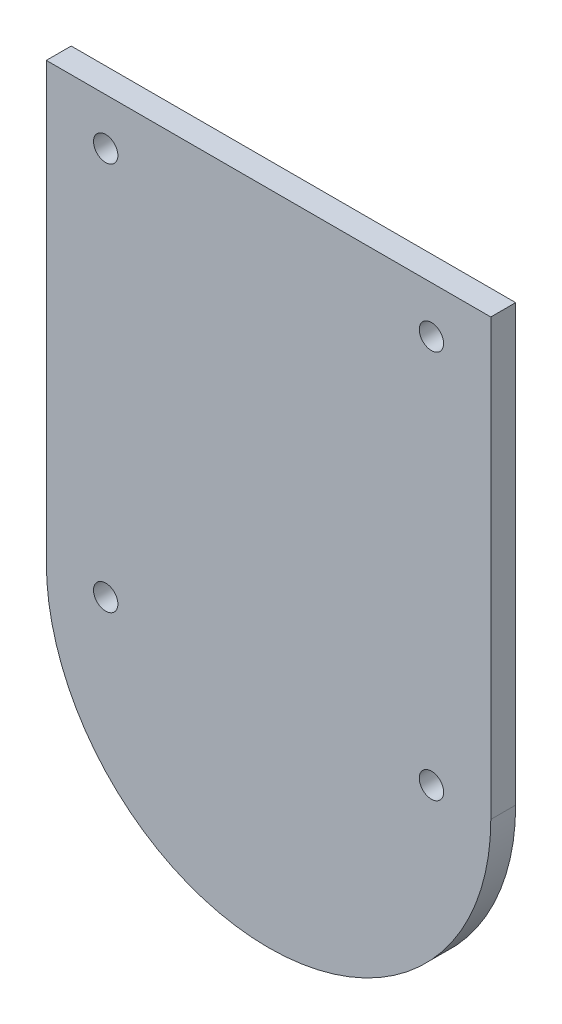
ISO-10303-21;
HEADER;
FILE_DESCRIPTION(('STEP AP214'),'2;1');
FILE_NAME('part.step','',(''),(''),'','','');
FILE_SCHEMA(('AUTOMOTIVE_DESIGN { 1 0 10303 214 1 1 1 1 }'));
ENDSEC;
DATA;
#1=APPLICATION_CONTEXT('core data for automotive mechanical design processes');
#2=APPLICATION_PROTOCOL_DEFINITION('international standard','automotive_design',2000,#1);
#3=PRODUCT_CONTEXT('',#1,'mechanical');
#4=PRODUCT('Part','Part','',(#3));
#5=PRODUCT_RELATED_PRODUCT_CATEGORY('part','',(#4));
#6=PRODUCT_DEFINITION_FORMATION('','',#4);
#7=PRODUCT_DEFINITION_CONTEXT('part definition',#1,'design');
#8=PRODUCT_DEFINITION('design','',#6,#7);
#9=PRODUCT_DEFINITION_SHAPE('','',#8);
#10=(LENGTH_UNIT() NAMED_UNIT(*) SI_UNIT(.MILLI.,.METRE.));
#11=(NAMED_UNIT(*) PLANE_ANGLE_UNIT() SI_UNIT($,.RADIAN.));
#12=(NAMED_UNIT(*) SI_UNIT($,.STERADIAN.) SOLID_ANGLE_UNIT());
#13=UNCERTAINTY_MEASURE_WITH_UNIT(LENGTH_MEASURE(1.E-05),#10,'distance_accuracy_value','');
#14=(GEOMETRIC_REPRESENTATION_CONTEXT(3) GLOBAL_UNCERTAINTY_ASSIGNED_CONTEXT((#13)) GLOBAL_UNIT_ASSIGNED_CONTEXT((#10,
#11,#12)) REPRESENTATION_CONTEXT('',''));
#15=CARTESIAN_POINT('',(0.,0.,0.));
#16=DIRECTION('',(0.,0.,1.));
#17=DIRECTION('',(1.,0.,0.));
#18=AXIS2_PLACEMENT_3D('',#15,#16,#17);
#19=CARTESIAN_POINT('',(0.,27.6698090416413,1.6));
#20=DIRECTION('',(0.,1.,0.));
#21=DIRECTION('',(0.,0.,1.));
#22=AXIS2_PLACEMENT_3D('',#19,#20,#21);
#23=PLANE('',#22);
#24=DIRECTION('',(1.,0.,0.));
#25=VECTOR('',#24,1.);
#26=CARTESIAN_POINT('',(0.,27.6698090416413,0.));
#27=LINE('',#26,#25);
#28=CARTESIAN_POINT('',(-37.2121128013917,27.6698090416413,0.));
#29=VERTEX_POINT('',#28);
#30=CARTESIAN_POINT('',(-8.61211280139167,27.6698090416413,0.));
#31=VERTEX_POINT('',#30);
#32=EDGE_CURVE('E75',#29,#31,#27,.T.);
#33=ORIENTED_EDGE('',*,*,#32,.F.);
#34=DIRECTION('',(0.,0.,-1.));
#35=VECTOR('',#34,1.);
#36=CARTESIAN_POINT('',(-37.2121128013917,27.6698090416413,1.6));
#37=LINE('',#36,#35);
#38=CARTESIAN_POINT('',(-37.2121128013917,27.6698090416413,1.6));
#39=VERTEX_POINT('',#38);
#40=EDGE_CURVE('E11',#39,#29,#37,.T.);
#41=ORIENTED_EDGE('',*,*,#40,.F.);
#42=DIRECTION('',(1.,0.,0.));
#43=VECTOR('',#42,1.);
#44=CARTESIAN_POINT('',(0.,27.6698090416413,1.6));
#45=LINE('',#44,#43);
#46=CARTESIAN_POINT('',(-8.61211280139167,27.6698090416413,1.6));
#47=VERTEX_POINT('',#46);
#48=EDGE_CURVE('E81',#39,#47,#45,.T.);
#49=ORIENTED_EDGE('',*,*,#48,.T.);
#50=DIRECTION('',(0.,0.,-1.));
#51=VECTOR('',#50,1.);
#52=CARTESIAN_POINT('',(-8.61211280139167,27.6698090416413,1.6));
#53=LINE('',#52,#51);
#54=EDGE_CURVE('E53',#47,#31,#53,.T.);
#55=ORIENTED_EDGE('',*,*,#54,.T.);
#56=EDGE_LOOP('',(#33,#41,#49,#55));
#57=FACE_BOUND('',#56,.T.);
#58=ADVANCED_FACE('F37',(#57),#23,.T.);
#59=CARTESIAN_POINT('',(-37.2121128013917,0.,1.6));
#60=DIRECTION('',(1.,0.,0.));
#61=DIRECTION('',(0.,0.,-1.));
#62=AXIS2_PLACEMENT_3D('',#59,#60,#61);
#63=PLANE('',#62);
#64=DIRECTION('',(0.,-1.,0.));
#65=VECTOR('',#64,1.);
#66=CARTESIAN_POINT('',(-37.2121128013917,0.,0.));
#67=LINE('',#66,#65);
#68=CARTESIAN_POINT('',(-37.2121128013917,-0.330212606078735,0.));
#69=VERTEX_POINT('',#68);
#70=EDGE_CURVE('E94',#29,#69,#67,.T.);
#71=ORIENTED_EDGE('',*,*,#70,.T.);
#72=DIRECTION('',(0.,0.,-1.));
#73=VECTOR('',#72,1.);
#74=CARTESIAN_POINT('',(-37.2121128013917,-0.330212606078735,1.6));
#75=LINE('',#74,#73);
#76=CARTESIAN_POINT('',(-37.2121128013917,-0.330212606078735,1.6));
#77=VERTEX_POINT('',#76);
#78=EDGE_CURVE('E45',#77,#69,#75,.T.);
#79=ORIENTED_EDGE('',*,*,#78,.F.);
#80=DIRECTION('',(0.,-1.,0.));
#81=VECTOR('',#80,1.);
#82=CARTESIAN_POINT('',(-37.2121128013917,0.,1.6));
#83=LINE('',#82,#81);
#84=EDGE_CURVE('E84',#39,#77,#83,.T.);
#85=ORIENTED_EDGE('',*,*,#84,.F.);
#86=ORIENTED_EDGE('',*,*,#40,.T.);
#87=EDGE_LOOP('',(#71,#79,#85,#86));
#88=FACE_BOUND('',#87,.T.);
#89=ADVANCED_FACE('F93',(#88),#63,.F.);
#90=CARTESIAN_POINT('',(-22.9121128013917,-0.330201782079756,1.6));
#91=DIRECTION('',(0.,0.,-1.));
#92=DIRECTION('',(-1.,0.,0.));
#93=AXIS2_PLACEMENT_3D('',#90,#91,#92);
#94=CYLINDRICAL_SURFACE('',#93,14.3000000000041);
#95=CARTESIAN_POINT('',(-22.9121128013917,-0.330201782079756,0.));
#96=DIRECTION('',(0.,0.,1.));
#97=DIRECTION('',(1.,0.,0.));
#98=AXIS2_PLACEMENT_3D('',#95,#96,#97);
#99=CIRCLE('',#98,14.3000000000041);
#100=CARTESIAN_POINT('',(-8.61211280139167,-0.330190958080777,0.));
#101=VERTEX_POINT('',#100);
#102=EDGE_CURVE('E117',#69,#101,#99,.T.);
#103=ORIENTED_EDGE('',*,*,#102,.T.);
#104=DIRECTION('',(0.,0.,-1.));
#105=VECTOR('',#104,1.);
#106=CARTESIAN_POINT('',(-8.61211280139167,-0.330190958080777,1.6));
#107=LINE('',#106,#105);
#108=CARTESIAN_POINT('',(-8.61211280139167,-0.330190958080777,1.6));
#109=VERTEX_POINT('',#108);
#110=EDGE_CURVE('E67',#109,#101,#107,.T.);
#111=ORIENTED_EDGE('',*,*,#110,.F.);
#112=CARTESIAN_POINT('',(-22.9121128013917,-0.330201782079756,1.6));
#113=DIRECTION('',(0.,0.,1.));
#114=DIRECTION('',(1.,0.,0.));
#115=AXIS2_PLACEMENT_3D('',#112,#113,#114);
#116=CIRCLE('',#115,14.3000000000041);
#117=EDGE_CURVE('E89',#77,#109,#116,.T.);
#118=ORIENTED_EDGE('',*,*,#117,.F.);
#119=ORIENTED_EDGE('',*,*,#78,.T.);
#120=EDGE_LOOP('',(#103,#111,#118,#119));
#121=FACE_BOUND('',#120,.T.);
#122=ADVANCED_FACE('F97',(#121),#94,.T.);
#123=CARTESIAN_POINT('',(-33.3921128013234,-0.330190958080774,1.6));
#124=DIRECTION('',(0.,0.,-1.));
#125=DIRECTION('',(-1.,0.,0.));
#126=AXIS2_PLACEMENT_3D('',#123,#124,#125);
#127=CYLINDRICAL_SURFACE('',#126,0.783493599999997);
#128=CARTESIAN_POINT('',(-33.3921128013234,-0.330190958080774,1.6));
#129=DIRECTION('',(0.,0.,1.));
#130=DIRECTION('',(1.,0.,0.));
#131=AXIS2_PLACEMENT_3D('',#128,#129,#130);
#132=CIRCLE('',#131,0.783493599999997);
#133=CARTESIAN_POINT('',(-32.6086192013234,-0.330190958080774,1.6));
#134=VERTEX_POINT('',#133);
#135=EDGE_CURVE('E109',#134,#134,#132,.T.);
#136=ORIENTED_EDGE('',*,*,#135,.T.);
#137=EDGE_LOOP('',(#136));
#138=FACE_BOUND('',#137,.T.);
#139=CARTESIAN_POINT('',(-33.3921128013234,-0.330190958080774,0.));
#140=DIRECTION('',(0.,0.,1.));
#141=DIRECTION('',(1.,0.,0.));
#142=AXIS2_PLACEMENT_3D('',#139,#140,#141);
#143=CIRCLE('',#142,0.783493599999997);
#144=CARTESIAN_POINT('',(-32.6086192013234,-0.330190958080774,0.));
#145=VERTEX_POINT('',#144);
#146=EDGE_CURVE('E127',#145,#145,#143,.T.);
#147=ORIENTED_EDGE('',*,*,#146,.F.);
#148=EDGE_LOOP('',(#147));
#149=FACE_BOUND('',#148,.T.);
#150=ADVANCED_FACE('F169',(#138,#149),#127,.F.);
#151=CARTESIAN_POINT('',(-12.4321128013234,24.6698090419192,1.6));
#152=DIRECTION('',(0.,0.,-1.));
#153=DIRECTION('',(-1.,0.,0.));
#154=AXIS2_PLACEMENT_3D('',#151,#152,#153);
#155=CYLINDRICAL_SURFACE('',#154,0.783493600000001);
#156=CARTESIAN_POINT('',(-12.4321128013234,24.6698090419192,1.6));
#157=DIRECTION('',(0.,0.,1.));
#158=DIRECTION('',(1.,0.,0.));
#159=AXIS2_PLACEMENT_3D('',#156,#157,#158);
#160=CIRCLE('',#159,0.783493600000001);
#161=CARTESIAN_POINT('',(-11.6486192013234,24.6698090419192,1.6));
#162=VERTEX_POINT('',#161);
#163=EDGE_CURVE('E106',#162,#162,#160,.T.);
#164=ORIENTED_EDGE('',*,*,#163,.T.);
#165=EDGE_LOOP('',(#164));
#166=FACE_BOUND('',#165,.T.);
#167=CARTESIAN_POINT('',(-12.4321128013234,24.6698090419192,0.));
#168=DIRECTION('',(0.,0.,1.));
#169=DIRECTION('',(1.,0.,0.));
#170=AXIS2_PLACEMENT_3D('',#167,#168,#169);
#171=CIRCLE('',#170,0.783493600000001);
#172=CARTESIAN_POINT('',(-11.6486192013234,24.6698090419192,0.));
#173=VERTEX_POINT('',#172);
#174=EDGE_CURVE('E124',#173,#173,#171,.T.);
#175=ORIENTED_EDGE('',*,*,#174,.F.);
#176=EDGE_LOOP('',(#175));
#177=FACE_BOUND('',#176,.T.);
#178=ADVANCED_FACE('F174',(#166,#177),#155,.F.);
#179=CARTESIAN_POINT('',(-33.3921128013234,24.6698090419192,1.6));
#180=DIRECTION('',(0.,0.,-1.));
#181=DIRECTION('',(-1.,0.,0.));
#182=AXIS2_PLACEMENT_3D('',#179,#180,#181);
#183=CYLINDRICAL_SURFACE('',#182,0.783493599999997);
#184=CARTESIAN_POINT('',(-33.3921128013234,24.6698090419192,1.6));
#185=DIRECTION('',(0.,0.,1.));
#186=DIRECTION('',(1.,0.,0.));
#187=AXIS2_PLACEMENT_3D('',#184,#185,#186);
#188=CIRCLE('',#187,0.783493599999997);
#189=CARTESIAN_POINT('',(-32.6086192013234,24.6698090419192,1.6));
#190=VERTEX_POINT('',#189);
#191=EDGE_CURVE('E100',#190,#190,#188,.T.);
#192=ORIENTED_EDGE('',*,*,#191,.T.);
#193=EDGE_LOOP('',(#192));
#194=FACE_BOUND('',#193,.T.);
#195=CARTESIAN_POINT('',(-33.3921128013234,24.6698090419192,0.));
#196=DIRECTION('',(0.,0.,1.));
#197=DIRECTION('',(1.,0.,0.));
#198=AXIS2_PLACEMENT_3D('',#195,#196,#197);
#199=CIRCLE('',#198,0.783493599999997);
#200=CARTESIAN_POINT('',(-32.6086192013234,24.6698090419192,0.));
#201=VERTEX_POINT('',#200);
#202=EDGE_CURVE('E121',#201,#201,#199,.T.);
#203=ORIENTED_EDGE('',*,*,#202,.F.);
#204=EDGE_LOOP('',(#203));
#205=FACE_BOUND('',#204,.T.);
#206=ADVANCED_FACE('F158',(#194,#205),#183,.F.);
#207=CARTESIAN_POINT('',(-8.61211280139167,0.,1.6));
#208=DIRECTION('',(1.,0.,0.));
#209=DIRECTION('',(0.,1.,0.));
#210=AXIS2_PLACEMENT_3D('',#207,#208,#209);
#211=PLANE('',#210);
#212=DIRECTION('',(0.,-1.,0.));
#213=VECTOR('',#212,1.);
#214=CARTESIAN_POINT('',(-8.61211280139167,0.,0.));
#215=LINE('',#214,#213);
#216=EDGE_CURVE('E119',#31,#101,#215,.T.);
#217=ORIENTED_EDGE('',*,*,#216,.F.);
#218=ORIENTED_EDGE('',*,*,#54,.F.);
#219=DIRECTION('',(0.,-1.,0.));
#220=VECTOR('',#219,1.);
#221=CARTESIAN_POINT('',(-8.61211280139167,0.,1.6));
#222=LINE('',#221,#220);
#223=EDGE_CURVE('E98',#47,#109,#222,.T.);
#224=ORIENTED_EDGE('',*,*,#223,.T.);
#225=ORIENTED_EDGE('',*,*,#110,.T.);
#226=EDGE_LOOP('',(#217,#218,#224,#225));
#227=FACE_BOUND('',#226,.T.);
#228=ADVANCED_FACE('F135',(#227),#211,.T.);
#229=CARTESIAN_POINT('',(-12.4321128013234,-0.330190958080816,1.6));
#230=DIRECTION('',(0.,0.,-1.));
#231=DIRECTION('',(-1.,0.,0.));
#232=AXIS2_PLACEMENT_3D('',#229,#230,#231);
#233=CYLINDRICAL_SURFACE('',#232,0.783493600000001);
#234=CARTESIAN_POINT('',(-12.4321128013234,-0.330190958080816,1.6));
#235=DIRECTION('',(0.,0.,1.));
#236=DIRECTION('',(1.,0.,0.));
#237=AXIS2_PLACEMENT_3D('',#234,#235,#236);
#238=CIRCLE('',#237,0.783493600000001);
#239=CARTESIAN_POINT('',(-11.6486192013234,-0.330190958080816,1.6));
#240=VERTEX_POINT('',#239);
#241=EDGE_CURVE('E112',#240,#240,#238,.T.);
#242=ORIENTED_EDGE('',*,*,#241,.T.);
#243=EDGE_LOOP('',(#242));
#244=FACE_BOUND('',#243,.T.);
#245=CARTESIAN_POINT('',(-12.4321128013234,-0.330190958080816,0.));
#246=DIRECTION('',(0.,0.,1.));
#247=DIRECTION('',(1.,0.,0.));
#248=AXIS2_PLACEMENT_3D('',#245,#246,#247);
#249=CIRCLE('',#248,0.783493600000001);
#250=CARTESIAN_POINT('',(-11.6486192013234,-0.330190958080816,0.));
#251=VERTEX_POINT('',#250);
#252=EDGE_CURVE('E130',#251,#251,#249,.T.);
#253=ORIENTED_EDGE('',*,*,#252,.F.);
#254=EDGE_LOOP('',(#253));
#255=FACE_BOUND('',#254,.T.);
#256=ADVANCED_FACE('F148',(#244,#255),#233,.F.);
#257=CARTESIAN_POINT('',(0.,0.,1.6));
#258=DIRECTION('',(0.,0.,1.));
#259=DIRECTION('',(1.,0.,0.));
#260=AXIS2_PLACEMENT_3D('',#257,#258,#259);
#261=PLANE('',#260);
#262=ORIENTED_EDGE('',*,*,#48,.F.);
#263=ORIENTED_EDGE('',*,*,#84,.T.);
#264=ORIENTED_EDGE('',*,*,#117,.T.);
#265=ORIENTED_EDGE('',*,*,#223,.F.);
#266=EDGE_LOOP('',(#262,#263,#264,#265));
#267=FACE_BOUND('',#266,.T.);
#268=ORIENTED_EDGE('',*,*,#191,.F.);
#269=EDGE_LOOP('',(#268));
#270=FACE_BOUND('',#269,.T.);
#271=ORIENTED_EDGE('',*,*,#163,.F.);
#272=EDGE_LOOP('',(#271));
#273=FACE_BOUND('',#272,.T.);
#274=ORIENTED_EDGE('',*,*,#135,.F.);
#275=EDGE_LOOP('',(#274));
#276=FACE_BOUND('',#275,.T.);
#277=ORIENTED_EDGE('',*,*,#241,.F.);
#278=EDGE_LOOP('',(#277));
#279=FACE_BOUND('',#278,.T.);
#280=ADVANCED_FACE('F86',(#267,#270,#273,#276,#279),#261,.T.);
#281=CARTESIAN_POINT('',(0.,0.,0.));
#282=DIRECTION('',(0.,0.,1.));
#283=DIRECTION('',(1.,0.,0.));
#284=AXIS2_PLACEMENT_3D('',#281,#282,#283);
#285=PLANE('',#284);
#286=ORIENTED_EDGE('',*,*,#32,.T.);
#287=ORIENTED_EDGE('',*,*,#216,.T.);
#288=ORIENTED_EDGE('',*,*,#102,.F.);
#289=ORIENTED_EDGE('',*,*,#70,.F.);
#290=EDGE_LOOP('',(#286,#287,#288,#289));
#291=FACE_BOUND('',#290,.T.);
#292=ORIENTED_EDGE('',*,*,#202,.T.);
#293=EDGE_LOOP('',(#292));
#294=FACE_BOUND('',#293,.T.);
#295=ORIENTED_EDGE('',*,*,#174,.T.);
#296=EDGE_LOOP('',(#295));
#297=FACE_BOUND('',#296,.T.);
#298=ORIENTED_EDGE('',*,*,#146,.T.);
#299=EDGE_LOOP('',(#298));
#300=FACE_BOUND('',#299,.T.);
#301=ORIENTED_EDGE('',*,*,#252,.T.);
#302=EDGE_LOOP('',(#301));
#303=FACE_BOUND('',#302,.T.);
#304=ADVANCED_FACE('F136',(#291,#294,#297,#300,#303),#285,.F.);
#305=CLOSED_SHELL('',(#58,#89,#122,#150,#178,#206,#228,#256,#280,#304));
#306=MANIFOLD_SOLID_BREP('B2',#305);
#307=ADVANCED_BREP_SHAPE_REPRESENTATION('',(#18,#306),#14);
#308=SHAPE_DEFINITION_REPRESENTATION(#9,#307);
ENDSEC;
END-ISO-10303-21;
